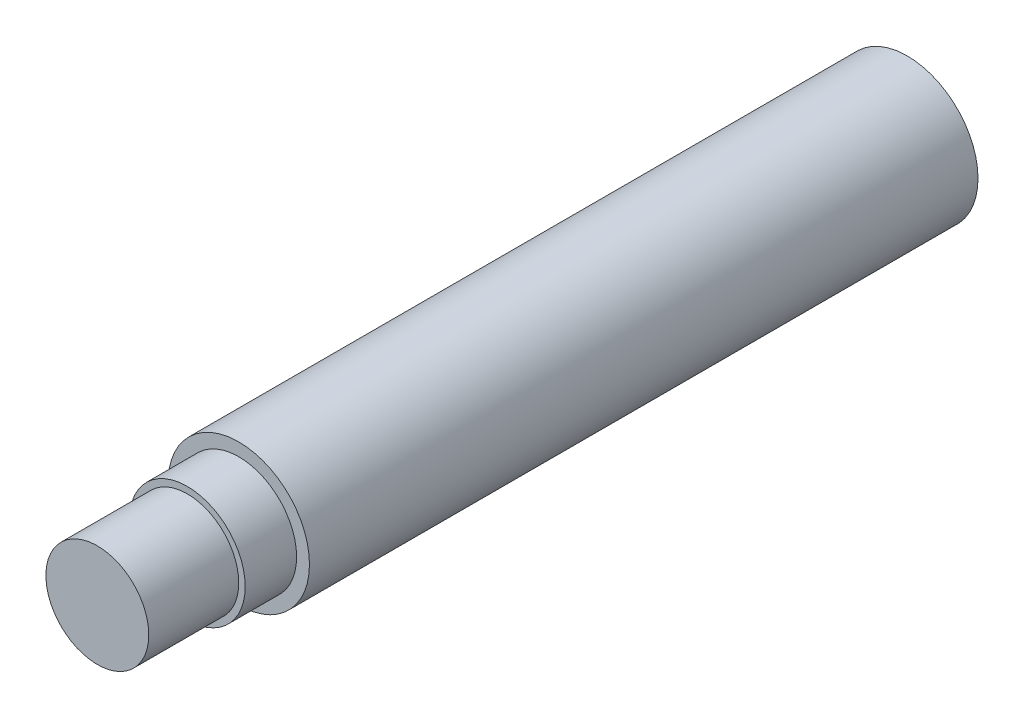
ISO-10303-21;
HEADER;
FILE_DESCRIPTION(('STEP AP214'),'2;1');
FILE_NAME('part.step','',(''),(''),'','','');
FILE_SCHEMA(('AUTOMOTIVE_DESIGN { 1 0 10303 214 1 1 1 1 }'));
ENDSEC;
DATA;
#1=APPLICATION_CONTEXT('core data for automotive mechanical design processes');
#2=APPLICATION_PROTOCOL_DEFINITION('international standard','automotive_design',2000,#1);
#3=PRODUCT_CONTEXT('',#1,'mechanical');
#4=PRODUCT('Part','Part','',(#3));
#5=PRODUCT_RELATED_PRODUCT_CATEGORY('part','',(#4));
#6=PRODUCT_DEFINITION_FORMATION('','',#4);
#7=PRODUCT_DEFINITION_CONTEXT('part definition',#1,'design');
#8=PRODUCT_DEFINITION('design','',#6,#7);
#9=PRODUCT_DEFINITION_SHAPE('','',#8);
#10=(LENGTH_UNIT() NAMED_UNIT(*) SI_UNIT(.MILLI.,.METRE.));
#11=(NAMED_UNIT(*) PLANE_ANGLE_UNIT() SI_UNIT($,.RADIAN.));
#12=(NAMED_UNIT(*) SI_UNIT($,.STERADIAN.) SOLID_ANGLE_UNIT());
#13=UNCERTAINTY_MEASURE_WITH_UNIT(LENGTH_MEASURE(1.E-05),#10,'distance_accuracy_value','');
#14=(GEOMETRIC_REPRESENTATION_CONTEXT(3) GLOBAL_UNCERTAINTY_ASSIGNED_CONTEXT((#13)) GLOBAL_UNIT_ASSIGNED_CONTEXT((#10,
#11,#12)) REPRESENTATION_CONTEXT('',''));
#15=CARTESIAN_POINT('',(0.,0.,0.));
#16=DIRECTION('',(0.,0.,1.));
#17=DIRECTION('',(1.,0.,0.));
#18=AXIS2_PLACEMENT_3D('',#15,#16,#17);
#19=CARTESIAN_POINT('',(0.,4.,0.));
#20=DIRECTION('',(0.,0.,-1.));
#21=DIRECTION('',(-1.,0.,0.));
#22=AXIS2_PLACEMENT_3D('',#19,#20,#21);
#23=PLANE('',#22);
#24=CARTESIAN_POINT('',(0.,0.,0.));
#25=DIRECTION('',(0.,0.,1.));
#26=DIRECTION('',(1.,0.,0.));
#27=AXIS2_PLACEMENT_3D('',#24,#25,#26);
#28=CIRCLE('',#27,4.);
#29=CARTESIAN_POINT('',(4.,0.,0.));
#30=VERTEX_POINT('',#29);
#31=EDGE_CURVE('E68',#30,#30,#28,.T.);
#32=ORIENTED_EDGE('',*,*,#31,.T.);
#33=EDGE_LOOP('',(#32));
#34=FACE_BOUND('',#33,.T.);
#35=ADVANCED_FACE('F32',(#34),#23,.F.);
#36=CARTESIAN_POINT('',(0.,2.5,-63.));
#37=DIRECTION('',(0.,0.,1.));
#38=DIRECTION('',(1.,0.,0.));
#39=AXIS2_PLACEMENT_3D('',#36,#37,#38);
#40=PLANE('',#39);
#41=CARTESIAN_POINT('',(0.,0.,-63.));
#42=DIRECTION('',(0.,0.,-1.));
#43=DIRECTION('',(-1.,0.,0.));
#44=AXIS2_PLACEMENT_3D('',#41,#42,#43);
#45=CIRCLE('',#44,3.5);
#46=CARTESIAN_POINT('',(-3.5,0.,-63.));
#47=VERTEX_POINT('',#46);
#48=EDGE_CURVE('E123',#47,#47,#45,.T.);
#49=ORIENTED_EDGE('',*,*,#48,.F.);
#50=EDGE_LOOP('',(#49));
#51=FACE_BOUND('',#50,.T.);
#52=CARTESIAN_POINT('',(0.,0.,-63.));
#53=DIRECTION('',(0.,0.,1.));
#54=DIRECTION('',(1.,0.,0.));
#55=AXIS2_PLACEMENT_3D('',#52,#53,#54);
#56=CIRCLE('',#55,5.5);
#57=CARTESIAN_POINT('',(5.5,0.,-63.));
#58=VERTEX_POINT('',#57);
#59=EDGE_CURVE('E39',#58,#58,#56,.T.);
#60=ORIENTED_EDGE('',*,*,#59,.F.);
#61=EDGE_LOOP('',(#60));
#62=FACE_BOUND('',#61,.T.);
#63=ADVANCED_FACE('F58',(#51,#62),#40,.F.);
#64=CARTESIAN_POINT('',(0.,0.,0.));
#65=DIRECTION('',(0.,0.,1.));
#66=DIRECTION('',(1.,0.,0.));
#67=AXIS2_PLACEMENT_3D('',#64,#65,#66);
#68=CYLINDRICAL_SURFACE('',#67,5.5);
#69=CARTESIAN_POINT('',(0.,0.,-11.));
#70=DIRECTION('',(0.,0.,1.));
#71=DIRECTION('',(1.,0.,0.));
#72=AXIS2_PLACEMENT_3D('',#69,#70,#71);
#73=CIRCLE('',#72,5.49999999999999);
#74=CARTESIAN_POINT('',(5.49999999999999,0.,-11.));
#75=VERTEX_POINT('',#74);
#76=EDGE_CURVE('E85',#75,#75,#73,.T.);
#77=ORIENTED_EDGE('',*,*,#76,.F.);
#78=EDGE_LOOP('',(#77));
#79=FACE_BOUND('',#78,.T.);
#80=ORIENTED_EDGE('',*,*,#59,.T.);
#81=EDGE_LOOP('',(#80));
#82=FACE_BOUND('',#81,.T.);
#83=ADVANCED_FACE('F63',(#79,#82),#68,.T.);
#84=CARTESIAN_POINT('',(0.,5.49999999999999,-11.));
#85=DIRECTION('',(0.,0.,-1.));
#86=DIRECTION('',(-1.,0.,0.));
#87=AXIS2_PLACEMENT_3D('',#84,#85,#86);
#88=PLANE('',#87);
#89=CARTESIAN_POINT('',(0.,0.,-11.));
#90=DIRECTION('',(0.,0.,1.));
#91=DIRECTION('',(1.,0.,0.));
#92=AXIS2_PLACEMENT_3D('',#89,#90,#91);
#93=CIRCLE('',#92,4.5);
#94=CARTESIAN_POINT('',(4.5,0.,-11.));
#95=VERTEX_POINT('',#94);
#96=EDGE_CURVE('E82',#95,#95,#93,.T.);
#97=ORIENTED_EDGE('',*,*,#96,.F.);
#98=EDGE_LOOP('',(#97));
#99=FACE_BOUND('',#98,.T.);
#100=ORIENTED_EDGE('',*,*,#76,.T.);
#101=EDGE_LOOP('',(#100));
#102=FACE_BOUND('',#101,.T.);
#103=ADVANCED_FACE('F93',(#99,#102),#88,.F.);
#104=CARTESIAN_POINT('',(0.,0.,0.));
#105=DIRECTION('',(0.,0.,1.));
#106=DIRECTION('',(1.,0.,0.));
#107=AXIS2_PLACEMENT_3D('',#104,#105,#106);
#108=CYLINDRICAL_SURFACE('',#107,4.5);
#109=CARTESIAN_POINT('',(0.,0.,-7.));
#110=DIRECTION('',(0.,0.,1.));
#111=DIRECTION('',(1.,0.,0.));
#112=AXIS2_PLACEMENT_3D('',#109,#110,#111);
#113=CIRCLE('',#112,4.5);
#114=CARTESIAN_POINT('',(4.5,0.,-7.));
#115=VERTEX_POINT('',#114);
#116=EDGE_CURVE('E73',#115,#115,#113,.T.);
#117=ORIENTED_EDGE('',*,*,#116,.F.);
#118=EDGE_LOOP('',(#117));
#119=FACE_BOUND('',#118,.T.);
#120=ORIENTED_EDGE('',*,*,#96,.T.);
#121=EDGE_LOOP('',(#120));
#122=FACE_BOUND('',#121,.T.);
#123=ADVANCED_FACE('F99',(#119,#122),#108,.T.);
#124=CARTESIAN_POINT('',(0.,4.5,-7.));
#125=DIRECTION('',(0.,0.,-1.));
#126=DIRECTION('',(-1.,0.,0.));
#127=AXIS2_PLACEMENT_3D('',#124,#125,#126);
#128=PLANE('',#127);
#129=CARTESIAN_POINT('',(0.,0.,-7.));
#130=DIRECTION('',(0.,0.,1.));
#131=DIRECTION('',(1.,0.,0.));
#132=AXIS2_PLACEMENT_3D('',#129,#130,#131);
#133=CIRCLE('',#132,4.);
#134=CARTESIAN_POINT('',(4.,0.,-7.));
#135=VERTEX_POINT('',#134);
#136=EDGE_CURVE('E70',#135,#135,#133,.T.);
#137=ORIENTED_EDGE('',*,*,#136,.F.);
#138=EDGE_LOOP('',(#137));
#139=FACE_BOUND('',#138,.T.);
#140=ORIENTED_EDGE('',*,*,#116,.T.);
#141=EDGE_LOOP('',(#140));
#142=FACE_BOUND('',#141,.T.);
#143=ADVANCED_FACE('F106',(#139,#142),#128,.F.);
#144=CARTESIAN_POINT('',(0.,0.,0.));
#145=DIRECTION('',(0.,0.,1.));
#146=DIRECTION('',(1.,0.,0.));
#147=AXIS2_PLACEMENT_3D('',#144,#145,#146);
#148=CYLINDRICAL_SURFACE('',#147,4.);
#149=ORIENTED_EDGE('',*,*,#31,.F.);
#150=EDGE_LOOP('',(#149));
#151=FACE_BOUND('',#150,.T.);
#152=ORIENTED_EDGE('',*,*,#136,.T.);
#153=EDGE_LOOP('',(#152));
#154=FACE_BOUND('',#153,.T.);
#155=ADVANCED_FACE('F110',(#151,#154),#148,.T.);
#156=CARTESIAN_POINT('',(0.,0.,-57.));
#157=DIRECTION('',(0.,0.,-1.));
#158=DIRECTION('',(-1.,0.,0.));
#159=AXIS2_PLACEMENT_3D('',#156,#157,#158);
#160=CONICAL_SURFACE('',#159,3.5,1.02974425867665);
#161=CARTESIAN_POINT('',(0.,0.,-57.));
#162=DIRECTION('',(0.,0.,-1.));
#163=DIRECTION('',(-1.,0.,0.));
#164=AXIS2_PLACEMENT_3D('',#161,#162,#163);
#165=CIRCLE('',#164,3.5);
#166=CARTESIAN_POINT('',(-3.5,0.,-57.));
#167=VERTEX_POINT('',#166);
#168=EDGE_CURVE('E76',#167,#167,#165,.T.);
#169=ORIENTED_EDGE('',*,*,#168,.T.);
#170=EDGE_LOOP('',(#169));
#171=FACE_BOUND('',#170,.T.);
#172=CARTESIAN_POINT('',(0.,0.,-56.3991393809724));
#173=DIRECTION('',(0.,0.,-1.));
#174=DIRECTION('',(-1.,0.,0.));
#175=AXIS2_PLACEMENT_3D('',#172,#173,#174);
#176=CIRCLE('',#175,2.5);
#177=CARTESIAN_POINT('',(-2.5,0.,-56.3991393809724));
#178=VERTEX_POINT('',#177);
#179=EDGE_CURVE('E35',#178,#178,#176,.T.);
#180=ORIENTED_EDGE('',*,*,#179,.F.);
#181=EDGE_LOOP('',(#180));
#182=FACE_BOUND('',#181,.T.);
#183=ADVANCED_FACE('F53',(#171,#182),#160,.F.);
#184=CARTESIAN_POINT('',(0.,0.,-63.));
#185=DIRECTION('',(0.,0.,-1.));
#186=DIRECTION('',(-1.,0.,0.));
#187=AXIS2_PLACEMENT_3D('',#184,#185,#186);
#188=CYLINDRICAL_SURFACE('',#187,3.5);
#189=ORIENTED_EDGE('',*,*,#168,.F.);
#190=EDGE_LOOP('',(#189));
#191=FACE_BOUND('',#190,.T.);
#192=ORIENTED_EDGE('',*,*,#48,.T.);
#193=EDGE_LOOP('',(#192));
#194=FACE_BOUND('',#193,.T.);
#195=ADVANCED_FACE('F45',(#191,#194),#188,.F.);
#196=CARTESIAN_POINT('',(0.,0.,-22.6707264208463));
#197=DIRECTION('',(0.,0.,-1.));
#198=DIRECTION('',(-1.,0.,0.));
#199=AXIS2_PLACEMENT_3D('',#196,#197,#198);
#200=CONICAL_SURFACE('',#199,0.,1.08210413623649);
#201=CARTESIAN_POINT('',(0.,0.,-24.));
#202=DIRECTION('',(0.,0.,1.));
#203=DIRECTION('',(1.,0.,0.));
#204=AXIS2_PLACEMENT_3D('',#201,#202,#203);
#205=CIRCLE('',#204,2.5);
#206=CARTESIAN_POINT('',(2.5,0.,-24.));
#207=VERTEX_POINT('',#206);
#208=EDGE_CURVE('E11',#207,#207,#205,.T.);
#209=ORIENTED_EDGE('',*,*,#208,.F.);
#210=EDGE_LOOP('',(#209));
#211=FACE_BOUND('',#210,.T.);
#212=CARTESIAN_POINT('',(0.,0.,-22.6707264208463));
#213=VERTEX_POINT('',#212);
#214=VERTEX_LOOP('',#213);
#215=FACE_BOUND('',#214,.T.);
#216=ADVANCED_FACE('F42',(#211,#215),#200,.F.);
#217=CARTESIAN_POINT('',(0.,0.,0.));
#218=DIRECTION('',(0.,0.,1.));
#219=DIRECTION('',(1.,0.,0.));
#220=AXIS2_PLACEMENT_3D('',#217,#218,#219);
#221=CYLINDRICAL_SURFACE('',#220,2.5);
#222=ORIENTED_EDGE('',*,*,#179,.T.);
#223=EDGE_LOOP('',(#222));
#224=FACE_BOUND('',#223,.T.);
#225=ORIENTED_EDGE('',*,*,#208,.T.);
#226=EDGE_LOOP('',(#225));
#227=FACE_BOUND('',#226,.T.);
#228=ADVANCED_FACE('F44',(#224,#227),#221,.F.);
#229=CLOSED_SHELL('',(#35,#63,#83,#103,#123,#143,#155,#183,#195,#216,#228));
#230=MANIFOLD_SOLID_BREP('B2',#229);
#231=ADVANCED_BREP_SHAPE_REPRESENTATION('',(#18,#230),#14);
#232=SHAPE_DEFINITION_REPRESENTATION(#9,#231);
ENDSEC;
END-ISO-10303-21;
